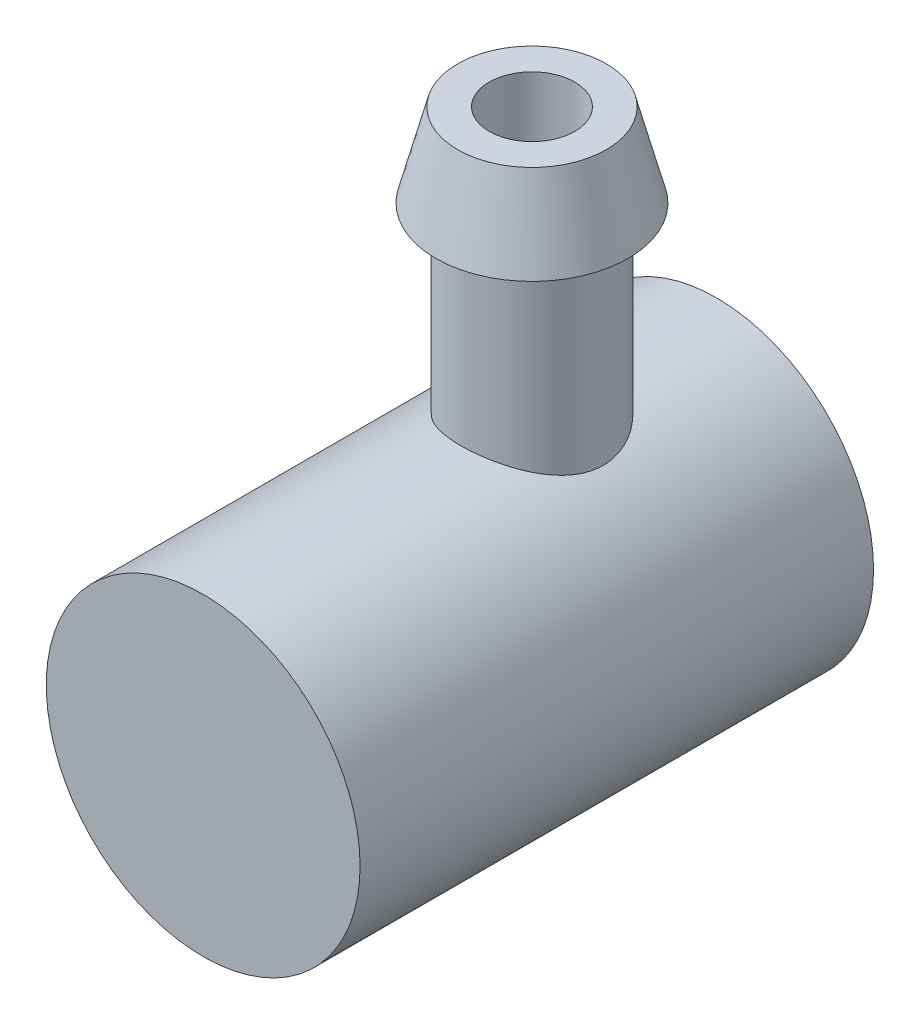
ISO-10303-21;
HEADER;
FILE_DESCRIPTION(('STEP AP214'),'2;1');
FILE_NAME('part.step','',(''),(''),'','','');
FILE_SCHEMA(('AUTOMOTIVE_DESIGN { 1 0 10303 214 1 1 1 1 }'));
ENDSEC;
DATA;
#1=APPLICATION_CONTEXT('core data for automotive mechanical design processes');
#2=APPLICATION_PROTOCOL_DEFINITION('international standard','automotive_design',2000,#1);
#3=PRODUCT_CONTEXT('',#1,'mechanical');
#4=PRODUCT('Part','Part','',(#3));
#5=PRODUCT_RELATED_PRODUCT_CATEGORY('part','',(#4));
#6=PRODUCT_DEFINITION_FORMATION('','',#4);
#7=PRODUCT_DEFINITION_CONTEXT('part definition',#1,'design');
#8=PRODUCT_DEFINITION('design','',#6,#7);
#9=PRODUCT_DEFINITION_SHAPE('','',#8);
#10=(LENGTH_UNIT() NAMED_UNIT(*) SI_UNIT(.MILLI.,.METRE.));
#11=(NAMED_UNIT(*) PLANE_ANGLE_UNIT() SI_UNIT($,.RADIAN.));
#12=(NAMED_UNIT(*) SI_UNIT($,.STERADIAN.) SOLID_ANGLE_UNIT());
#13=UNCERTAINTY_MEASURE_WITH_UNIT(LENGTH_MEASURE(1.E-05),#10,'distance_accuracy_value','');
#14=(GEOMETRIC_REPRESENTATION_CONTEXT(3) GLOBAL_UNCERTAINTY_ASSIGNED_CONTEXT((#13)) GLOBAL_UNIT_ASSIGNED_CONTEXT((#10,
#11,#12)) REPRESENTATION_CONTEXT('',''));
#15=CARTESIAN_POINT('',(0.,0.,0.));
#16=DIRECTION('',(0.,0.,1.));
#17=DIRECTION('',(1.,0.,0.));
#18=AXIS2_PLACEMENT_3D('',#15,#16,#17);
#19=CARTESIAN_POINT('',(0.,0.,-18.));
#20=DIRECTION('',(0.,0.,1.));
#21=DIRECTION('',(1.,0.,0.));
#22=AXIS2_PLACEMENT_3D('',#19,#20,#21);
#23=CYLINDRICAL_SURFACE('',#22,5.5);
#24=CARTESIAN_POINT('',(0.,0.,0.));
#25=DIRECTION('',(0.,0.,1.));
#26=DIRECTION('',(1.,0.,0.));
#27=AXIS2_PLACEMENT_3D('',#24,#25,#26);
#28=CIRCLE('',#27,5.5);
#29=CARTESIAN_POINT('',(5.5,0.,0.));
#30=VERTEX_POINT('',#29);
#31=EDGE_CURVE('E44',#30,#30,#28,.T.);
#32=ORIENTED_EDGE('',*,*,#31,.F.);
#33=EDGE_LOOP('',(#32));
#34=FACE_BOUND('',#33,.T.);
#35=CARTESIAN_POINT('',(0.,0.,-18.));
#36=DIRECTION('',(0.,0.,1.));
#37=DIRECTION('',(1.,0.,0.));
#38=AXIS2_PLACEMENT_3D('',#35,#36,#37);
#39=CIRCLE('',#38,5.5);
#40=CARTESIAN_POINT('',(5.5,0.,-18.));
#41=VERTEX_POINT('',#40);
#42=EDGE_CURVE('E10',#41,#41,#39,.T.);
#43=ORIENTED_EDGE('',*,*,#42,.T.);
#44=EDGE_LOOP('',(#43));
#45=FACE_BOUND('',#44,.T.);
#46=CARTESIAN_POINT('',(0.,5.5,-9.02628097101806));
#47=CARTESIAN_POINT('',(-0.132816145284357,5.49999369870931,-9.02628867759775));
#48=CARTESIAN_POINT('',(-0.265835701448803,5.49513526114601,-9.03692805953279));
#49=CARTESIAN_POINT('',(-0.528027896062537,5.47618102046917,-9.07905805686849));
#50=CARTESIAN_POINT('',(-0.657190881556424,5.46206378775658,-9.11059704643907));
#51=CARTESIAN_POINT('',(-0.907466739557298,5.42608787981103,-9.19308641817029));
#52=CARTESIAN_POINT('',(-1.02860698228922,5.40425732698846,-9.2439663346521));
#53=CARTESIAN_POINT('',(-1.26049169700434,5.35492606344154,-9.36337039037341));
#54=CARTESIAN_POINT('',(-1.37123824747009,5.32742648991282,-9.43189099160738));
#55=CARTESIAN_POINT('',(-1.58575279564469,5.26767788661504,-9.58876689575123));
#56=CARTESIAN_POINT('',(-1.68884771841108,5.23525516065229,-9.67797564862597));
#57=CARTESIAN_POINT('',(-1.87921167122033,5.169981608249,-9.87187988114109));
#58=CARTESIAN_POINT('',(-1.96647083094001,5.1371305283963,-9.9765849462251));
#59=CARTESIAN_POINT('',(-2.12798843737884,5.07244492450594,-10.2062259131462));
#60=CARTESIAN_POINT('',(-2.20112759491811,5.040794979573,-10.332006778069));
#61=CARTESIAN_POINT('',(-2.32491325493927,4.98491966737432,-10.5957129902061));
#62=CARTESIAN_POINT('',(-2.37557345021863,4.96068978306032,-10.7336308827614));
#63=CARTESIAN_POINT('',(-2.45005627758752,4.9243140427224,-11.0099764566511));
#64=CARTESIAN_POINT('',(-2.47518302941618,4.91158514421169,-11.147972551753));
#65=CARTESIAN_POINT('',(-2.50193279260797,4.89801821463239,-11.426762916434));
#66=CARTESIAN_POINT('',(-2.50357264087074,4.89717166555205,-11.5675551090817));
#67=CARTESIAN_POINT('',(-2.48427141198995,4.90698153027191,-11.8336916912814));
#68=CARTESIAN_POINT('',(-2.46545016283118,4.91655818122591,-11.9592383005769));
#69=CARTESIAN_POINT('',(-2.4093676508794,4.94428109958009,-12.2051470475274));
#70=CARTESIAN_POINT('',(-2.37210198697065,4.96242941226084,-12.3255079403371));
#71=CARTESIAN_POINT('',(-2.27945184779561,5.00567208218791,-12.5609175509063));
#72=CARTESIAN_POINT('',(-2.22367420519436,5.03091516285485,-12.6757829570289));
#73=CARTESIAN_POINT('',(-2.09586859273949,5.08548488907163,-12.8950224262863));
#74=CARTESIAN_POINT('',(-2.02383365211919,5.11481328424216,-12.9993919611931));
#75=CARTESIAN_POINT('',(-1.85692478057703,5.17789221587211,-13.205927536242));
#76=CARTESIAN_POINT('',(-1.76046753299936,5.2117880598316,-13.3067737045527));
#77=CARTESIAN_POINT('',(-1.55174815249174,5.27769368397502,-13.4913492443049));
#78=CARTESIAN_POINT('',(-1.43948082103431,5.30970283886444,-13.5750729634046));
#79=CARTESIAN_POINT('',(-1.19766281925566,5.36950534618767,-13.7254876549777));
#80=CARTESIAN_POINT('',(-1.06767206685173,5.39712978524095,-13.7915434500418));
#81=CARTESIAN_POINT('',(-0.796844896081458,5.44369936052484,-13.9003693668971));
#82=CARTESIAN_POINT('',(-0.656015701378204,5.46265022004357,-13.9431548471979));
#83=CARTESIAN_POINT('',(-0.37844991435549,5.48860490400603,-14.0012363403815));
#84=CARTESIAN_POINT('',(-0.242154484202896,5.49637394767751,-14.0182973702267));
#85=CARTESIAN_POINT('',(0.0315660436282514,5.50161007334277,-14.029827855479));
#86=CARTESIAN_POINT('',(0.168990715716223,5.49908087348691,-14.0243054645602));
#87=CARTESIAN_POINT('',(0.432146778493069,5.48448407938737,-13.9919951619752));
#88=CARTESIAN_POINT('',(0.558078127396235,5.47301153257062,-13.9665334494786));
#89=CARTESIAN_POINT('',(0.803693463481536,5.44237110560927,-13.8970136448924));
#90=CARTESIAN_POINT('',(0.923376701955517,5.42320230560714,-13.8529533298623));
#91=CARTESIAN_POINT('',(1.15732747516372,5.37821815950354,-13.7461112229359));
#92=CARTESIAN_POINT('',(1.27131180951637,5.35221506502489,-13.6827910361416));
#93=CARTESIAN_POINT('',(1.48744614928835,5.29622400098564,-13.5398134163521));
#94=CARTESIAN_POINT('',(1.58959093424205,5.26623428600456,-13.460148819105));
#95=CARTESIAN_POINT('',(1.78819128612951,5.2023213866395,-13.2789703178931));
#96=CARTESIAN_POINT('',(1.88345063650186,5.16827928194194,-13.1761840802684));
#97=CARTESIAN_POINT('',(2.05579555974773,5.10218027178943,-12.9557186047779));
#98=CARTESIAN_POINT('',(2.13287371467411,5.0701241805496,-12.8380333180733));
#99=CARTESIAN_POINT('',(2.26851417742739,5.01093675854132,-12.5868268021843));
#100=CARTESIAN_POINT('',(2.32651178086012,4.98396428661225,-12.4529602268161));
#101=CARTESIAN_POINT('',(2.41857144488097,4.93995555801825,-12.1757315575939));
#102=CARTESIAN_POINT('',(2.45265831910444,4.9229090037493,-12.0323794770568));
#103=CARTESIAN_POINT('',(2.49325807507769,4.90246200756536,-11.7537183513435));
#104=CARTESIAN_POINT('',(2.5019188531559,4.89799994349809,-11.6188000484158));
#105=CARTESIAN_POINT('',(2.49737021161822,4.90032179261342,-11.3494478795479));
#106=CARTESIAN_POINT('',(2.48416607010203,4.90710299172005,-11.2150139045433));
#107=CARTESIAN_POINT('',(2.4381684933062,4.93010341873286,-10.9596546748809));
#108=CARTESIAN_POINT('',(2.40671995185147,4.94567287009983,-10.8384223522613));
#109=CARTESIAN_POINT('',(2.32658661605855,4.98386936157558,-10.6029881567478));
#110=CARTESIAN_POINT('',(2.2778967772596,5.00649846696795,-10.4887883529205));
#111=CARTESIAN_POINT('',(2.1610419547488,5.05808484439917,-10.2624939319889));
#112=CARTESIAN_POINT('',(2.09181431853015,5.08735847849273,-10.1510218539154));
#113=CARTESIAN_POINT('',(1.93719380028804,5.14822130854099,-9.94061226173853));
#114=CARTESIAN_POINT('',(1.85179378769227,5.17981152212113,-9.84168030895125));
#115=CARTESIAN_POINT('',(1.65784520472974,5.2452790147138,-9.64962076968314));
#116=CARTESIAN_POINT('',(1.54788097332246,5.27909503785502,-9.55789356544751));
#117=CARTESIAN_POINT('',(1.31300676588176,5.34236067072088,-9.39401948179155));
#118=CARTESIAN_POINT('',(1.18808990453652,5.3718082548044,-9.32188167315898));
#119=CARTESIAN_POINT('',(0.927398695048433,5.42285296457391,-9.2002596807732));
#120=CARTESIAN_POINT('',(0.791729654695486,5.44451694348196,-9.15058158678956));
#121=CARTESIAN_POINT('',(0.582817222347258,5.46948623676269,-9.09409179641294));
#122=CARTESIAN_POINT('',(0.51233672759082,5.4765522405717,-9.07827188521428));
#123=CARTESIAN_POINT('',(0.370074071775204,5.48799750884364,-9.0527708605361));
#124=CARTESIAN_POINT('',(0.298292830256236,5.49237860050235,-9.0430855720366));
#125=CARTESIAN_POINT('',(0.188612294978529,5.49689395714262,-9.03312010786544));
#126=CARTESIAN_POINT('',(0.150946407387661,5.49805724033138,-9.03055711011395));
#127=CARTESIAN_POINT('',(0.07552583110842,5.49961116371431,-9.02713643272765));
#128=CARTESIAN_POINT('',(0.0377711410607125,5.50000179200307,-9.02627877936954));
#129=CARTESIAN_POINT('',(0.,5.5,-9.02628097101806));
#130=B_SPLINE_CURVE_WITH_KNOTS('',3,(#46,#47,#48,#49,#50,#51,#52,#53,#54,#55,#56,#57,#58,#59,
#60,#61,#62,#63,#64,#65,#66,#67,#68,#69,#70,#71,#72,#73,#74,#75,#76,#77,#78,#79,#80,#81,#82,#83,
#84,#85,#86,#87,#88,#89,#90,#91,#92,#93,#94,#95,#96,#97,#98,#99,#100,#101,#102,#103,#104,#105,
#106,#107,#108,#109,#110,#111,#112,#113,#114,#115,#116,#117,#118,#119,#120,#121,#122,#123,#124,
#125,#126,#127,#128,#129),.UNSPECIFIED.,.T.,.F.,(4,2,2,2,2,2,2,2,2,2,2,2,2,2,2,2,2,2,2,2,2,2,2,
2,2,2,2,2,2,2,2,2,2,2,2,2,2,2,2,2,2,4),(0.,0.398300931001202,0.797527003400661,1.19531228574912,
1.59301785057736,2.01163405819865,2.43051029696777,2.8749655137827,3.31914962297436,
3.73929338084823,4.15913593798615,4.53929253779887,4.91953989247825,5.30844370198958,
5.6975145826618,6.1264236824533,6.55547414294633,6.99833839939004,7.44091000768855,
7.85145915894037,8.26186009578161,8.64706845596611,9.03232287003282,9.42952911220836,
9.8269098353609,10.2576285831247,10.6885227618009,11.1312140224167,11.5734451926766,
11.9770599127743,12.3805772161773,12.7575667492601,13.1346666732434,13.5363493613727,
13.9382095697602,14.3775242869152,14.8170420813821,15.2526891454276,15.4701654657451,
15.6874936194379,15.800763348909,15.9140348236778),.UNSPECIFIED.);
#131=CARTESIAN_POINT('',(0.,5.5,-9.02628097101806));
#132=VERTEX_POINT('',#131);
#133=EDGE_CURVE('E53',#132,#132,#130,.T.);
#134=ORIENTED_EDGE('',*,*,#133,.T.);
#135=EDGE_LOOP('',(#134));
#136=FACE_BOUND('',#135,.T.);
#137=ADVANCED_FACE('F31',(#34,#45,#136),#23,.T.);
#138=CARTESIAN_POINT('',(0.,0.,-18.));
#139=DIRECTION('',(0.,0.,1.));
#140=DIRECTION('',(1.,0.,0.));
#141=AXIS2_PLACEMENT_3D('',#138,#139,#140);
#142=PLANE('',#141);
#143=ORIENTED_EDGE('',*,*,#42,.F.);
#144=EDGE_LOOP('',(#143));
#145=FACE_BOUND('',#144,.T.);
#146=ADVANCED_FACE('F81',(#145),#142,.F.);
#147=CARTESIAN_POINT('',(0.,0.,0.));
#148=DIRECTION('',(0.,0.,1.));
#149=DIRECTION('',(1.,0.,0.));
#150=AXIS2_PLACEMENT_3D('',#147,#148,#149);
#151=PLANE('',#150);
#152=ORIENTED_EDGE('',*,*,#31,.T.);
#153=EDGE_LOOP('',(#152));
#154=FACE_BOUND('',#153,.T.);
#155=ADVANCED_FACE('F79',(#154),#151,.T.);
#156=CARTESIAN_POINT('',(0.,14.5396295178548,-11.5262809710181));
#157=DIRECTION('',(0.,1.,0.));
#158=DIRECTION('',(0.,0.,1.));
#159=AXIS2_PLACEMENT_3D('',#156,#157,#158);
#160=CYLINDRICAL_SURFACE('',#159,1.5);
#161=CARTESIAN_POINT('',(0.,5.5,-10.0262809710181));
#162=CARTESIAN_POINT('',(0.0826209133321935,5.49999882717412,-10.0262827836291));
#163=CARTESIAN_POINT('',(0.165260978812708,5.49812007260761,-10.0331300346015));
#164=CARTESIAN_POINT('',(0.328155930157697,5.49080798085451,-10.0602868013212));
#165=CARTESIAN_POINT('',(0.408409727977265,5.48537304740499,-10.0806023626467));
#166=CARTESIAN_POINT('',(0.564157626055395,5.47154772174135,-10.1339827027565));
#167=CARTESIAN_POINT('',(0.639657866970163,5.46316123869395,-10.16703062368));
#168=CARTESIAN_POINT('',(0.784044496159719,5.44431654412848,-10.2448739036805));
#169=CARTESIAN_POINT('',(0.852930363289777,5.43385816956517,-10.289670187372));
#170=CARTESIAN_POINT('',(0.98379694757326,5.41171397042059,-10.3908808074853));
#171=CARTESIAN_POINT('',(1.04559512916994,5.4000064149043,-10.4475264118723));
#172=CARTESIAN_POINT('',(1.15894293682478,5.37682112935063,-10.570333607048));
#173=CARTESIAN_POINT('',(1.21049117824721,5.36534343055203,-10.6364964814204));
#174=CARTESIAN_POINT('',(1.30277794539497,5.34369384163659,-10.7779322185975));
#175=CARTESIAN_POINT('',(1.34330426837586,5.33354930058623,-10.8533481159543));
#176=CARTESIAN_POINT('',(1.41102916361227,5.31603507411917,-11.0102447992174));
#177=CARTESIAN_POINT('',(1.43823031946844,5.30866485085754,-11.0917244059066));
#178=CARTESIAN_POINT('',(1.47789456441268,5.2977584719274,-11.2564088660305));
#179=CARTESIAN_POINT('',(1.49068960543229,5.29413612283787,-11.33952791918));
#180=CARTESIAN_POINT('',(1.50221364409133,5.29087829084083,-11.5068056540269));
#181=CARTESIAN_POINT('',(1.50094540140882,5.2912420257326,-11.5909641285181));
#182=CARTESIAN_POINT('',(1.48464191780301,5.29583824875456,-11.7553225219843));
#183=CARTESIAN_POINT('',(1.47001073668932,5.29995718313671,-11.8355662056203));
#184=CARTESIAN_POINT('',(1.42804483871807,5.3114175579406,-11.9924142570409));
#185=CARTESIAN_POINT('',(1.40070906504647,5.31875926644153,-12.0690183214844));
#186=CARTESIAN_POINT('',(1.3337862982647,5.33593618292326,-12.2174544915655));
#187=CARTESIAN_POINT('',(1.29405951882947,5.34579959764141,-12.2892201720517));
#188=CARTESIAN_POINT('',(1.20357988022174,5.36689368797792,-12.4252074184277));
#189=CARTESIAN_POINT('',(1.15282476106209,5.37812464363249,-12.4894274338568));
#190=CARTESIAN_POINT('',(1.03967346682896,5.40115894990605,-12.6108061608245));
#191=CARTESIAN_POINT('',(0.97693864616725,5.41296874297114,-12.667648420307));
#192=CARTESIAN_POINT('',(0.842682011788635,5.43548647707978,-12.7700719359958));
#193=CARTESIAN_POINT('',(0.771159819718553,5.44619437064292,-12.8156527070677));
#194=CARTESIAN_POINT('',(0.620853953739623,5.46537278121261,-12.894407643793));
#195=CARTESIAN_POINT('',(0.542037637417773,5.47383251287305,-12.927522309602));
#196=CARTESIAN_POINT('',(0.37967268871439,5.48748356142612,-12.9799389435322));
#197=CARTESIAN_POINT('',(0.296125144317682,5.49267562644564,-12.9992440734622));
#198=CARTESIAN_POINT('',(0.129368170483251,5.49909228776313,-13.022991588815));
#199=CARTESIAN_POINT('',(0.0462242977839801,5.50043163125371,-13.0278639663384));
#200=CARTESIAN_POINT('',(-0.119693365637972,5.49932301585136,-13.0237982235046));
#201=CARTESIAN_POINT('',(-0.202467195532507,5.49687546782998,-13.0148616014016));
#202=CARTESIAN_POINT('',(-0.363745097739556,5.48854239265957,-12.9837834683149));
#203=CARTESIAN_POINT('',(-0.442299324272676,5.48271986472129,-12.9618837782611));
#204=CARTESIAN_POINT('',(-0.594609867448631,5.46829923535645,-12.9057837263776));
#205=CARTESIAN_POINT('',(-0.668365651304996,5.45970082634473,-12.8715820013568));
#206=CARTESIAN_POINT('',(-0.81064116119459,5.44041573828275,-12.7910645287324));
#207=CARTESIAN_POINT('',(-0.879024602412583,5.4296902954988,-12.7445174837565));
#208=CARTESIAN_POINT('',(-1.00716022013082,5.40738988410034,-12.6409196834728));
#209=CARTESIAN_POINT('',(-1.06691060617763,5.39581474001048,-12.5838667548606));
#210=CARTESIAN_POINT('',(-1.17791060344312,5.37269401558495,-12.4588669329832));
#211=CARTESIAN_POINT('',(-1.22885627747222,5.36115944983886,-12.3906475887391));
#212=CARTESIAN_POINT('',(-1.3185858220796,5.33980026187814,-12.2463823237988));
#213=CARTESIAN_POINT('',(-1.35737017925923,5.32997557125461,-12.1703367164105));
#214=CARTESIAN_POINT('',(-1.42138558317209,5.31326248703816,-12.0129403427761));
#215=CARTESIAN_POINT('',(-1.44669352306985,5.30635748202252,-11.9316227104928));
#216=CARTESIAN_POINT('',(-1.48320917220692,5.29626814696188,-11.7656641329905));
#217=CARTESIAN_POINT('',(-1.49442068863148,5.29308281231875,-11.6810240914644));
#218=CARTESIAN_POINT('',(-1.50219895576908,5.29088009671763,-11.5139425672006));
#219=CARTESIAN_POINT('',(-1.49925533217026,5.29172336001588,-11.4315253822956));
#220=CARTESIAN_POINT('',(-1.47994837643976,5.29715501736986,-11.2684103232831));
#221=CARTESIAN_POINT('',(-1.46358542028567,5.30174330649891,-11.187712401071));
#222=CARTESIAN_POINT('',(-1.41819408435119,5.31406316491799,-11.0309746552419));
#223=CARTESIAN_POINT('',(-1.38927395449127,5.32176783125817,-10.9549012177763));
#224=CARTESIAN_POINT('',(-1.31967304541386,5.33945189987963,-10.8086276942047));
#225=CARTESIAN_POINT('',(-1.27899034504456,5.34943167369227,-10.7384285699529));
#226=CARTESIAN_POINT('',(-1.18555430984851,5.37092379381814,-10.6035703733254));
#227=CARTESIAN_POINT('',(-1.13246901822125,5.38247375845259,-10.539147266175));
#228=CARTESIAN_POINT('',(-1.01636011199274,5.40559990490855,-10.4199645642235));
#229=CARTESIAN_POINT('',(-0.953334059387993,5.41717609247304,-10.3652073470127));
#230=CARTESIAN_POINT('',(-0.817407725686077,5.43936459177359,-10.2656863564987));
#231=CARTESIAN_POINT('',(-0.744315866262518,5.44994907753807,-10.2211774901511));
#232=CARTESIAN_POINT('',(-0.591399899839277,5.46865263780403,-10.1451485348066));
#233=CARTESIAN_POINT('',(-0.511579952421219,5.47677322151197,-10.1136204904637));
#234=CARTESIAN_POINT('',(-0.36010010121821,5.48864193995757,-10.0683414610391));
#235=CARTESIAN_POINT('',(-0.289064640262468,5.49286947681091,-10.0526064197764));
#236=CARTESIAN_POINT('',(-0.145357607941484,5.49854887164354,-10.0315759456992));
#237=CARTESIAN_POINT('',(-0.0726862155649468,5.5000010318002,-10.0262793763633));
#238=CARTESIAN_POINT('',(0.,5.5,-10.0262809710181));
#239=B_SPLINE_CURVE_WITH_KNOTS('',3,(#161,#162,#163,#164,#165,#166,#167,#168,#169,#170,#171,
#172,#173,#174,#175,#176,#177,#178,#179,#180,#181,#182,#183,#184,#185,#186,#187,#188,#189,#190,
#191,#192,#193,#194,#195,#196,#197,#198,#199,#200,#201,#202,#203,#204,#205,#206,#207,#208,#209,
#210,#211,#212,#213,#214,#215,#216,#217,#218,#219,#220,#221,#222,#223,#224,#225,#226,#227,#228,
#229,#230,#231,#232,#233,#234,#235,#236,#237,#238),.UNSPECIFIED.,.T.,.F.,(4,2,2,2,2,2,2,2,2,2,2,
2,2,2,2,2,2,2,2,2,2,2,2,2,2,2,2,2,2,2,2,2,2,2,2,2,2,2,4),(0.,0.247596106854897,
0.495303428551299,0.742683902420579,0.990083851364705,1.24285878223178,1.49566783659324,
1.75304593650219,2.01037411390996,2.26164304860926,2.51286267696538,2.75672886674887,
3.00061534583717,3.24735926767928,3.49415380139121,3.74938528550775,4.00462776284424,
4.26107349736028,4.51746049766944,4.76612811343082,5.0147687510525,5.25891111200195,
5.50308053475836,5.75219469009681,6.00136043656003,6.2579007306487,6.51443075867912,
6.76948096455404,7.0244622712421,7.27068852228629,7.51690787489588,7.76104555655817,
8.00522313517586,8.25689011392092,8.50861891104974,8.76605872289059,9.02334052607436,
9.2411883209319,9.45901239561305),.UNSPECIFIED.);
#240=CARTESIAN_POINT('',(0.,5.5,-10.0262809710181));
#241=VERTEX_POINT('',#240);
#242=EDGE_CURVE('E36',#241,#241,#239,.T.);
#243=ORIENTED_EDGE('',*,*,#242,.F.);
#244=EDGE_LOOP('',(#243));
#245=FACE_BOUND('',#244,.T.);
#246=CARTESIAN_POINT('',(0.,14.5396295178548,-11.5262809710181));
#247=DIRECTION('',(0.,1.,0.));
#248=DIRECTION('',(0.,0.,1.));
#249=AXIS2_PLACEMENT_3D('',#246,#247,#248);
#250=CIRCLE('',#249,1.5);
#251=CARTESIAN_POINT('',(0.,14.5396295178548,-10.0262809710181));
#252=VERTEX_POINT('',#251);
#253=EDGE_CURVE('E51',#252,#252,#250,.T.);
#254=ORIENTED_EDGE('',*,*,#253,.T.);
#255=EDGE_LOOP('',(#254));
#256=FACE_BOUND('',#255,.T.);
#257=ADVANCED_FACE('F74',(#245,#256),#160,.F.);
#258=CARTESIAN_POINT('',(0.,14.5396295178548,-13.0262809710181));
#259=DIRECTION('',(0.,-1.,0.));
#260=DIRECTION('',(0.,0.,-1.));
#261=AXIS2_PLACEMENT_3D('',#258,#259,#260);
#262=PLANE('',#261);
#263=ORIENTED_EDGE('',*,*,#253,.F.);
#264=EDGE_LOOP('',(#263));
#265=FACE_BOUND('',#264,.T.);
#266=CARTESIAN_POINT('',(0.,14.5396295178548,-11.5262809710181));
#267=DIRECTION('',(0.,1.,0.));
#268=DIRECTION('',(0.,0.,1.));
#269=AXIS2_PLACEMENT_3D('',#266,#267,#268);
#270=CIRCLE('',#269,2.60760065903487);
#271=CARTESIAN_POINT('',(0.,14.5396295178548,-8.91868031198319));
#272=VERTEX_POINT('',#271);
#273=EDGE_CURVE('E102',#272,#272,#270,.T.);
#274=ORIENTED_EDGE('',*,*,#273,.T.);
#275=EDGE_LOOP('',(#274));
#276=FACE_BOUND('',#275,.T.);
#277=ADVANCED_FACE('F71',(#265,#276),#262,.F.);
#278=CARTESIAN_POINT('',(0.,11.6190865940656,-11.5262809710181));
#279=DIRECTION('',(0.,-1.,0.));
#280=DIRECTION('',(0.,0.,-1.));
#281=AXIS2_PLACEMENT_3D('',#278,#279,#280);
#282=CONICAL_SURFACE('',#281,3.37147779092307,0.255822290341766);
#283=ORIENTED_EDGE('',*,*,#273,.F.);
#284=EDGE_LOOP('',(#283));
#285=FACE_BOUND('',#284,.T.);
#286=CARTESIAN_POINT('',(0.,11.6190865940656,-11.5262809710181));
#287=DIRECTION('',(0.,1.,0.));
#288=DIRECTION('',(0.,0.,1.));
#289=AXIS2_PLACEMENT_3D('',#286,#287,#288);
#290=CIRCLE('',#289,3.37147779092307);
#291=CARTESIAN_POINT('',(0.,11.6190865940656,-8.15480318009499));
#292=VERTEX_POINT('',#291);
#293=EDGE_CURVE('E104',#292,#292,#290,.T.);
#294=ORIENTED_EDGE('',*,*,#293,.T.);
#295=EDGE_LOOP('',(#294));
#296=FACE_BOUND('',#295,.T.);
#297=ADVANCED_FACE('F67',(#285,#296),#282,.T.);
#298=CARTESIAN_POINT('',(0.,11.6190865940656,-14.8977587619411));
#299=DIRECTION('',(0.,1.,0.));
#300=DIRECTION('',(0.,0.,1.));
#301=AXIS2_PLACEMENT_3D('',#298,#299,#300);
#302=PLANE('',#301);
#303=ORIENTED_EDGE('',*,*,#293,.F.);
#304=EDGE_LOOP('',(#303));
#305=FACE_BOUND('',#304,.T.);
#306=CARTESIAN_POINT('',(0.,11.6190865940656,-11.5262809710181));
#307=DIRECTION('',(0.,1.,0.));
#308=DIRECTION('',(0.,0.,1.));
#309=AXIS2_PLACEMENT_3D('',#306,#307,#308);
#310=CIRCLE('',#309,2.5);
#311=CARTESIAN_POINT('',(0.,11.6190865940656,-9.02628097101806));
#312=VERTEX_POINT('',#311);
#313=EDGE_CURVE('E108',#312,#312,#310,.T.);
#314=ORIENTED_EDGE('',*,*,#313,.T.);
#315=EDGE_LOOP('',(#314));
#316=FACE_BOUND('',#315,.T.);
#317=ADVANCED_FACE('F63',(#305,#316),#302,.F.);
#318=CARTESIAN_POINT('',(0.,14.5396295178548,-11.5262809710181));
#319=DIRECTION('',(0.,1.,0.));
#320=DIRECTION('',(0.,0.,1.));
#321=AXIS2_PLACEMENT_3D('',#318,#319,#320);
#322=CYLINDRICAL_SURFACE('',#321,2.5);
#323=ORIENTED_EDGE('',*,*,#133,.F.);
#324=EDGE_LOOP('',(#323));
#325=FACE_BOUND('',#324,.T.);
#326=ORIENTED_EDGE('',*,*,#313,.F.);
#327=EDGE_LOOP('',(#326));
#328=FACE_BOUND('',#327,.T.);
#329=ADVANCED_FACE('F59',(#325,#328),#322,.T.);
#330=ORIENTED_EDGE('',*,*,#242,.T.);
#331=EDGE_LOOP('',(#330));
#332=FACE_BOUND('',#331,.T.);
#333=ADVANCED_FACE('F33',(#332),#23,.T.);
#334=CLOSED_SHELL('',(#137,#146,#155,#257,#277,#297,#317,#329,#333));
#335=MANIFOLD_SOLID_BREP('B2',#334);
#336=ADVANCED_BREP_SHAPE_REPRESENTATION('',(#18,#335),#14);
#337=SHAPE_DEFINITION_REPRESENTATION(#9,#336);
ENDSEC;
END-ISO-10303-21;
